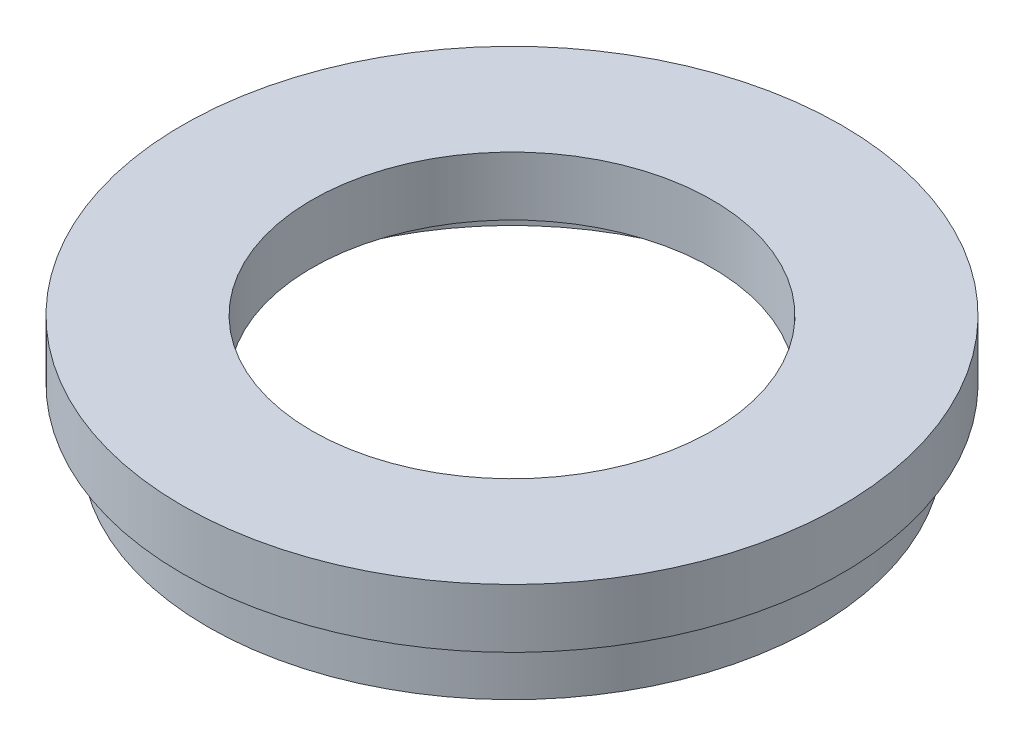
ISO-10303-21;
HEADER;
FILE_DESCRIPTION(('STEP AP214'),'2;1');
FILE_NAME('part.step','',(''),(''),'','','');
FILE_SCHEMA(('AUTOMOTIVE_DESIGN { 1 0 10303 214 1 1 1 1 }'));
ENDSEC;
DATA;
#1=APPLICATION_CONTEXT('core data for automotive mechanical design processes');
#2=APPLICATION_PROTOCOL_DEFINITION('international standard','automotive_design',2000,#1);
#3=PRODUCT_CONTEXT('',#1,'mechanical');
#4=PRODUCT('Part','Part','',(#3));
#5=PRODUCT_RELATED_PRODUCT_CATEGORY('part','',(#4));
#6=PRODUCT_DEFINITION_FORMATION('','',#4);
#7=PRODUCT_DEFINITION_CONTEXT('part definition',#1,'design');
#8=PRODUCT_DEFINITION('design','',#6,#7);
#9=PRODUCT_DEFINITION_SHAPE('','',#8);
#10=(LENGTH_UNIT() NAMED_UNIT(*) SI_UNIT(.MILLI.,.METRE.));
#11=(NAMED_UNIT(*) PLANE_ANGLE_UNIT() SI_UNIT($,.RADIAN.));
#12=(NAMED_UNIT(*) SI_UNIT($,.STERADIAN.) SOLID_ANGLE_UNIT());
#13=UNCERTAINTY_MEASURE_WITH_UNIT(LENGTH_MEASURE(1.E-05),#10,'distance_accuracy_value','');
#14=(GEOMETRIC_REPRESENTATION_CONTEXT(3) GLOBAL_UNCERTAINTY_ASSIGNED_CONTEXT((#13)) GLOBAL_UNIT_ASSIGNED_CONTEXT((#10,
#11,#12)) REPRESENTATION_CONTEXT('',''));
#15=CARTESIAN_POINT('',(0.,0.,0.));
#16=DIRECTION('',(0.,0.,1.));
#17=DIRECTION('',(1.,0.,0.));
#18=AXIS2_PLACEMENT_3D('',#15,#16,#17);
#19=CARTESIAN_POINT('',(0.,13.7446808510638,0.));
#20=DIRECTION('',(0.,1.,0.));
#21=DIRECTION('',(0.,0.,1.));
#22=AXIS2_PLACEMENT_3D('',#19,#20,#21);
#23=CYLINDRICAL_SURFACE('',#22,23.5);
#24=CARTESIAN_POINT('',(0.,0.,0.));
#25=DIRECTION('',(0.,1.,0.));
#26=DIRECTION('',(0.,0.,1.));
#27=AXIS2_PLACEMENT_3D('',#24,#25,#26);
#28=CIRCLE('',#27,23.5);
#29=CARTESIAN_POINT('',(0.,0.,23.5));
#30=VERTEX_POINT('',#29);
#31=EDGE_CURVE('E75',#30,#30,#28,.T.);
#32=ORIENTED_EDGE('',*,*,#31,.F.);
#33=EDGE_LOOP('',(#32));
#34=FACE_BOUND('',#33,.T.);
#35=CARTESIAN_POINT('',(0.,4.,0.));
#36=DIRECTION('',(0.,1.,0.));
#37=DIRECTION('',(0.,0.,1.));
#38=AXIS2_PLACEMENT_3D('',#35,#36,#37);
#39=CIRCLE('',#38,23.5);
#40=CARTESIAN_POINT('',(0.,4.,23.5));
#41=VERTEX_POINT('',#40);
#42=EDGE_CURVE('E10',#41,#41,#39,.T.);
#43=ORIENTED_EDGE('',*,*,#42,.T.);
#44=EDGE_LOOP('',(#43));
#45=FACE_BOUND('',#44,.T.);
#46=ADVANCED_FACE('F35',(#34,#45),#23,.F.);
#47=CARTESIAN_POINT('',(23.5,4.,0.));
#48=DIRECTION('',(0.,-1.,0.));
#49=DIRECTION('',(0.,0.,-1.));
#50=AXIS2_PLACEMENT_3D('',#47,#48,#49);
#51=PLANE('',#50);
#52=ORIENTED_EDGE('',*,*,#42,.F.);
#53=EDGE_LOOP('',(#52));
#54=FACE_BOUND('',#53,.T.);
#55=CARTESIAN_POINT('',(0.,4.,0.));
#56=DIRECTION('',(0.,1.,0.));
#57=DIRECTION('',(0.,0.,1.));
#58=AXIS2_PLACEMENT_3D('',#55,#56,#57);
#59=CIRCLE('',#58,24.1);
#60=CARTESIAN_POINT('',(0.,4.,24.1));
#61=VERTEX_POINT('',#60);
#62=EDGE_CURVE('E41',#61,#61,#59,.T.);
#63=ORIENTED_EDGE('',*,*,#62,.T.);
#64=EDGE_LOOP('',(#63));
#65=FACE_BOUND('',#64,.T.);
#66=ADVANCED_FACE('F82',(#54,#65),#51,.F.);
#67=CARTESIAN_POINT('',(0.,13.7446808510638,0.));
#68=DIRECTION('',(0.,1.,0.));
#69=DIRECTION('',(0.,0.,1.));
#70=AXIS2_PLACEMENT_3D('',#67,#68,#69);
#71=CYLINDRICAL_SURFACE('',#70,24.1);
#72=ORIENTED_EDGE('',*,*,#62,.F.);
#73=EDGE_LOOP('',(#72));
#74=FACE_BOUND('',#73,.T.);
#75=CARTESIAN_POINT('',(0.,5.,0.));
#76=DIRECTION('',(0.,1.,0.));
#77=DIRECTION('',(0.,0.,1.));
#78=AXIS2_PLACEMENT_3D('',#75,#76,#77);
#79=CIRCLE('',#78,24.1);
#80=CARTESIAN_POINT('',(0.,5.,24.1));
#81=VERTEX_POINT('',#80);
#82=EDGE_CURVE('E45',#81,#81,#79,.T.);
#83=ORIENTED_EDGE('',*,*,#82,.T.);
#84=EDGE_LOOP('',(#83));
#85=FACE_BOUND('',#84,.T.);
#86=ADVANCED_FACE('F86',(#74,#85),#71,.F.);
#87=CARTESIAN_POINT('',(24.1,5.,0.));
#88=DIRECTION('',(0.,1.,0.));
#89=DIRECTION('',(0.,0.,1.));
#90=AXIS2_PLACEMENT_3D('',#87,#88,#89);
#91=PLANE('',#90);
#92=ORIENTED_EDGE('',*,*,#82,.F.);
#93=EDGE_LOOP('',(#92));
#94=FACE_BOUND('',#93,.T.);
#95=CARTESIAN_POINT('',(0.,5.,0.));
#96=DIRECTION('',(0.,1.,0.));
#97=DIRECTION('',(0.,0.,1.));
#98=AXIS2_PLACEMENT_3D('',#95,#96,#97);
#99=CIRCLE('',#98,17.);
#100=CARTESIAN_POINT('',(0.,5.,17.));
#101=VERTEX_POINT('',#100);
#102=EDGE_CURVE('E49',#101,#101,#99,.T.);
#103=ORIENTED_EDGE('',*,*,#102,.T.);
#104=EDGE_LOOP('',(#103));
#105=FACE_BOUND('',#104,.T.);
#106=ADVANCED_FACE('F91',(#94,#105),#91,.F.);
#107=CARTESIAN_POINT('',(0.,13.7446808510638,0.));
#108=DIRECTION('',(0.,1.,0.));
#109=DIRECTION('',(0.,0.,1.));
#110=AXIS2_PLACEMENT_3D('',#107,#108,#109);
#111=CYLINDRICAL_SURFACE('',#110,17.);
#112=ORIENTED_EDGE('',*,*,#102,.F.);
#113=EDGE_LOOP('',(#112));
#114=FACE_BOUND('',#113,.T.);
#115=CARTESIAN_POINT('',(0.,10.,0.));
#116=DIRECTION('',(0.,1.,0.));
#117=DIRECTION('',(0.,0.,1.));
#118=AXIS2_PLACEMENT_3D('',#115,#116,#117);
#119=CIRCLE('',#118,17.);
#120=CARTESIAN_POINT('',(0.,10.,17.));
#121=VERTEX_POINT('',#120);
#122=EDGE_CURVE('E54',#121,#121,#119,.T.);
#123=ORIENTED_EDGE('',*,*,#122,.T.);
#124=EDGE_LOOP('',(#123));
#125=FACE_BOUND('',#124,.T.);
#126=ADVANCED_FACE('F97',(#114,#125),#111,.F.);
#127=CARTESIAN_POINT('',(17.,10.,0.));
#128=DIRECTION('',(0.,-1.,0.));
#129=DIRECTION('',(0.,0.,-1.));
#130=AXIS2_PLACEMENT_3D('',#127,#128,#129);
#131=PLANE('',#130);
#132=ORIENTED_EDGE('',*,*,#122,.F.);
#133=EDGE_LOOP('',(#132));
#134=FACE_BOUND('',#133,.T.);
#135=CARTESIAN_POINT('',(0.,10.,0.));
#136=DIRECTION('',(0.,1.,0.));
#137=DIRECTION('',(0.,0.,1.));
#138=AXIS2_PLACEMENT_3D('',#135,#136,#137);
#139=CIRCLE('',#138,28.);
#140=CARTESIAN_POINT('',(0.,10.,28.));
#141=VERTEX_POINT('',#140);
#142=EDGE_CURVE('E57',#141,#141,#139,.T.);
#143=ORIENTED_EDGE('',*,*,#142,.T.);
#144=EDGE_LOOP('',(#143));
#145=FACE_BOUND('',#144,.T.);
#146=ADVANCED_FACE('F101',(#134,#145),#131,.F.);
#147=CARTESIAN_POINT('',(0.,13.7446808510638,0.));
#148=DIRECTION('',(0.,1.,0.));
#149=DIRECTION('',(0.,0.,1.));
#150=AXIS2_PLACEMENT_3D('',#147,#148,#149);
#151=CYLINDRICAL_SURFACE('',#150,28.);
#152=ORIENTED_EDGE('',*,*,#142,.F.);
#153=EDGE_LOOP('',(#152));
#154=FACE_BOUND('',#153,.T.);
#155=CARTESIAN_POINT('',(0.,5.,0.));
#156=DIRECTION('',(0.,1.,0.));
#157=DIRECTION('',(0.,0.,1.));
#158=AXIS2_PLACEMENT_3D('',#155,#156,#157);
#159=CIRCLE('',#158,28.);
#160=CARTESIAN_POINT('',(0.,5.,28.));
#161=VERTEX_POINT('',#160);
#162=EDGE_CURVE('E60',#161,#161,#159,.T.);
#163=ORIENTED_EDGE('',*,*,#162,.T.);
#164=EDGE_LOOP('',(#163));
#165=FACE_BOUND('',#164,.T.);
#166=ADVANCED_FACE('F105',(#154,#165),#151,.T.);
#167=CARTESIAN_POINT('',(28.,5.,0.));
#168=DIRECTION('',(0.,1.,0.));
#169=DIRECTION('',(0.,0.,1.));
#170=AXIS2_PLACEMENT_3D('',#167,#168,#169);
#171=PLANE('',#170);
#172=ORIENTED_EDGE('',*,*,#162,.F.);
#173=EDGE_LOOP('',(#172));
#174=FACE_BOUND('',#173,.T.);
#175=CARTESIAN_POINT('',(0.,5.,0.));
#176=DIRECTION('',(0.,1.,0.));
#177=DIRECTION('',(0.,0.,1.));
#178=AXIS2_PLACEMENT_3D('',#175,#176,#177);
#179=CIRCLE('',#178,25.45);
#180=CARTESIAN_POINT('',(0.,5.,25.45));
#181=VERTEX_POINT('',#180);
#182=EDGE_CURVE('E63',#181,#181,#179,.T.);
#183=ORIENTED_EDGE('',*,*,#182,.T.);
#184=EDGE_LOOP('',(#183));
#185=FACE_BOUND('',#184,.T.);
#186=ADVANCED_FACE('F109',(#174,#185),#171,.F.);
#187=CARTESIAN_POINT('',(0.,13.7446808510638,0.));
#188=DIRECTION('',(0.,1.,0.));
#189=DIRECTION('',(0.,0.,1.));
#190=AXIS2_PLACEMENT_3D('',#187,#188,#189);
#191=CYLINDRICAL_SURFACE('',#190,25.45);
#192=ORIENTED_EDGE('',*,*,#182,.F.);
#193=EDGE_LOOP('',(#192));
#194=FACE_BOUND('',#193,.T.);
#195=CARTESIAN_POINT('',(0.,4.,0.));
#196=DIRECTION('',(0.,1.,0.));
#197=DIRECTION('',(0.,0.,1.));
#198=AXIS2_PLACEMENT_3D('',#195,#196,#197);
#199=CIRCLE('',#198,25.45);
#200=CARTESIAN_POINT('',(0.,4.,25.45));
#201=VERTEX_POINT('',#200);
#202=EDGE_CURVE('E66',#201,#201,#199,.T.);
#203=ORIENTED_EDGE('',*,*,#202,.T.);
#204=EDGE_LOOP('',(#203));
#205=FACE_BOUND('',#204,.T.);
#206=ADVANCED_FACE('F113',(#194,#205),#191,.T.);
#207=CARTESIAN_POINT('',(25.45,4.,0.));
#208=DIRECTION('',(0.,-1.,0.));
#209=DIRECTION('',(0.,0.,-1.));
#210=AXIS2_PLACEMENT_3D('',#207,#208,#209);
#211=PLANE('',#210);
#212=ORIENTED_EDGE('',*,*,#202,.F.);
#213=EDGE_LOOP('',(#212));
#214=FACE_BOUND('',#213,.T.);
#215=CARTESIAN_POINT('',(0.,4.,0.));
#216=DIRECTION('',(0.,1.,0.));
#217=DIRECTION('',(0.,0.,1.));
#218=AXIS2_PLACEMENT_3D('',#215,#216,#217);
#219=CIRCLE('',#218,25.845);
#220=CARTESIAN_POINT('',(0.,4.,25.845));
#221=VERTEX_POINT('',#220);
#222=EDGE_CURVE('E69',#221,#221,#219,.T.);
#223=ORIENTED_EDGE('',*,*,#222,.T.);
#224=EDGE_LOOP('',(#223));
#225=FACE_BOUND('',#224,.T.);
#226=ADVANCED_FACE('F117',(#214,#225),#211,.F.);
#227=CARTESIAN_POINT('',(0.,13.7446808510638,0.));
#228=DIRECTION('',(0.,1.,0.));
#229=DIRECTION('',(0.,0.,1.));
#230=AXIS2_PLACEMENT_3D('',#227,#228,#229);
#231=CYLINDRICAL_SURFACE('',#230,25.845);
#232=ORIENTED_EDGE('',*,*,#222,.F.);
#233=EDGE_LOOP('',(#232));
#234=FACE_BOUND('',#233,.T.);
#235=CARTESIAN_POINT('',(0.,0.,0.));
#236=DIRECTION('',(0.,1.,0.));
#237=DIRECTION('',(0.,0.,1.));
#238=AXIS2_PLACEMENT_3D('',#235,#236,#237);
#239=CIRCLE('',#238,25.845);
#240=CARTESIAN_POINT('',(0.,0.,25.845));
#241=VERTEX_POINT('',#240);
#242=EDGE_CURVE('E72',#241,#241,#239,.T.);
#243=ORIENTED_EDGE('',*,*,#242,.T.);
#244=EDGE_LOOP('',(#243));
#245=FACE_BOUND('',#244,.T.);
#246=ADVANCED_FACE('F121',(#234,#245),#231,.T.);
#247=CARTESIAN_POINT('',(25.845,0.,0.));
#248=DIRECTION('',(0.,1.,0.));
#249=DIRECTION('',(0.,0.,1.));
#250=AXIS2_PLACEMENT_3D('',#247,#248,#249);
#251=PLANE('',#250);
#252=ORIENTED_EDGE('',*,*,#242,.F.);
#253=EDGE_LOOP('',(#252));
#254=FACE_BOUND('',#253,.T.);
#255=ORIENTED_EDGE('',*,*,#31,.T.);
#256=EDGE_LOOP('',(#255));
#257=FACE_BOUND('',#256,.T.);
#258=ADVANCED_FACE('F79',(#254,#257),#251,.F.);
#259=CLOSED_SHELL('',(#46,#66,#86,#106,#126,#146,#166,#186,#206,#226,#246,#258));
#260=MANIFOLD_SOLID_BREP('B2',#259);
#261=ADVANCED_BREP_SHAPE_REPRESENTATION('',(#18,#260),#14);
#262=SHAPE_DEFINITION_REPRESENTATION(#9,#261);
ENDSEC;
END-ISO-10303-21;
